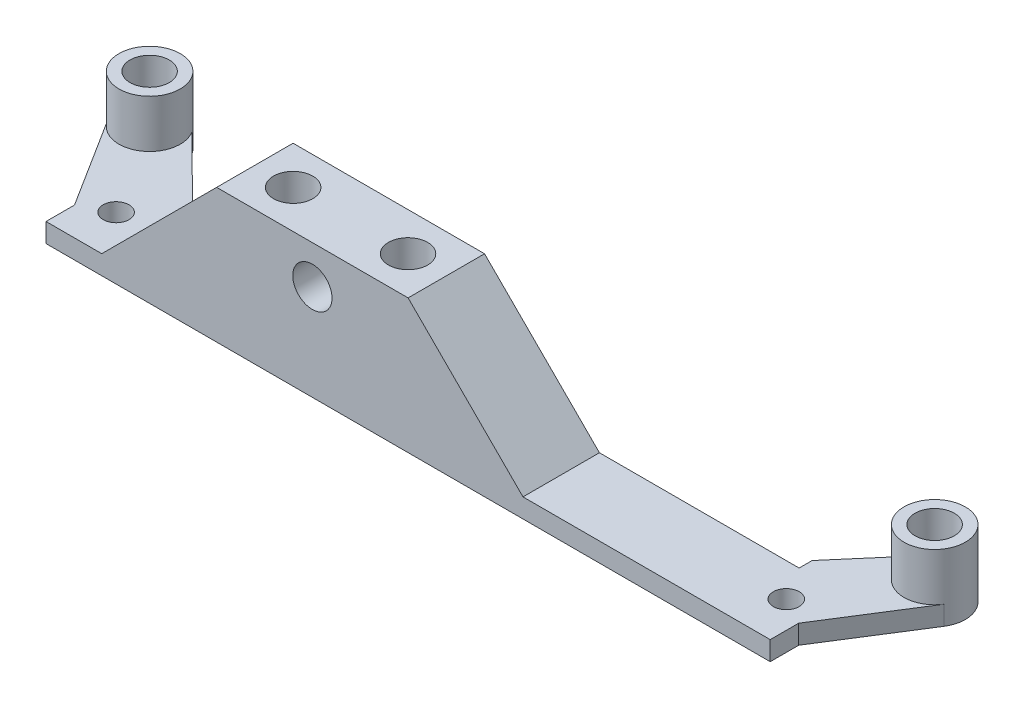
ISO-10303-21;
HEADER;
FILE_DESCRIPTION(('STEP AP214'),'2;1');
FILE_NAME('part.step','',(''),(''),'','','');
FILE_SCHEMA(('AUTOMOTIVE_DESIGN { 1 0 10303 214 1 1 1 1 }'));
ENDSEC;
DATA;
#1=APPLICATION_CONTEXT('core data for automotive mechanical design processes');
#2=APPLICATION_PROTOCOL_DEFINITION('international standard','automotive_design',2000,#1);
#3=PRODUCT_CONTEXT('',#1,'mechanical');
#4=PRODUCT('Part','Part','',(#3));
#5=PRODUCT_RELATED_PRODUCT_CATEGORY('part','',(#4));
#6=PRODUCT_DEFINITION_FORMATION('','',#4);
#7=PRODUCT_DEFINITION_CONTEXT('part definition',#1,'design');
#8=PRODUCT_DEFINITION('design','',#6,#7);
#9=PRODUCT_DEFINITION_SHAPE('','',#8);
#10=(LENGTH_UNIT() NAMED_UNIT(*) SI_UNIT(.MILLI.,.METRE.));
#11=(NAMED_UNIT(*) PLANE_ANGLE_UNIT() SI_UNIT($,.RADIAN.));
#12=(NAMED_UNIT(*) SI_UNIT($,.STERADIAN.) SOLID_ANGLE_UNIT());
#13=UNCERTAINTY_MEASURE_WITH_UNIT(LENGTH_MEASURE(1.E-05),#10,'distance_accuracy_value','');
#14=(GEOMETRIC_REPRESENTATION_CONTEXT(3) GLOBAL_UNCERTAINTY_ASSIGNED_CONTEXT((#13)) GLOBAL_UNIT_ASSIGNED_CONTEXT((#10,
#11,#12)) REPRESENTATION_CONTEXT('',''));
#15=CARTESIAN_POINT('',(0.,0.,0.));
#16=DIRECTION('',(0.,0.,1.));
#17=DIRECTION('',(1.,0.,0.));
#18=AXIS2_PLACEMENT_3D('',#15,#16,#17);
#19=CARTESIAN_POINT('',(50.2954250844381,2.,24.539505555981));
#20=DIRECTION('',(0.,-1.,0.));
#21=DIRECTION('',(0.,0.,1.));
#22=AXIS2_PLACEMENT_3D('',#19,#20,#21);
#23=PLANE('',#22);
#24=CARTESIAN_POINT('',(44.2954250844381,2.,34.0395055559811));
#25=DIRECTION('',(0.,-1.,0.));
#26=DIRECTION('',(0.,0.,-1.));
#27=AXIS2_PLACEMENT_3D('',#24,#25,#26);
#28=CIRCLE('',#27,1.35);
#29=CARTESIAN_POINT('',(44.2954250844381,2.,32.6895055559811));
#30=VERTEX_POINT('',#29);
#31=EDGE_CURVE('E231',#30,#30,#28,.T.);
#32=ORIENTED_EDGE('',*,*,#31,.T.);
#33=EDGE_LOOP('',(#32));
#34=FACE_BOUND('',#33,.T.);
#35=DIRECTION('',(-1.,0.,0.));
#36=VECTOR('',#35,1.);
#37=CARTESIAN_POINT('',(-28.5276596570278,2.,38.5395055559811));
#38=LINE('',#37,#36);
#39=CARTESIAN_POINT('',(47.1182480924058,2.,38.5395055559811));
#40=VERTEX_POINT('',#39);
#41=CARTESIAN_POINT('',(21.2954250843891,2.,38.5395055559811));
#42=VERTEX_POINT('',#41);
#43=EDGE_CURVE('E165',#40,#42,#38,.T.);
#44=ORIENTED_EDGE('',*,*,#43,.F.);
#45=DIRECTION('',(0.,0.,1.));
#46=VECTOR('',#45,1.);
#47=CARTESIAN_POINT('',(47.1182480924058,2.,38.5395055559811));
#48=LINE('',#47,#46);
#49=CARTESIAN_POINT('',(47.1182480924058,2.,35.5626238078308));
#50=VERTEX_POINT('',#49);
#51=EDGE_CURVE('E199',#50,#40,#48,.T.);
#52=ORIENTED_EDGE('',*,*,#51,.F.);
#53=DIRECTION('',(-0.53399299138798,0.,0.845488903030973));
#54=VECTOR('',#53,1.);
#55=CARTESIAN_POINT('',(53.0009895741372,2.,26.2482831284226));
#56=LINE('',#55,#54);
#57=CARTESIAN_POINT('',(53.0009895741372,2.,26.2482831284226));
#58=VERTEX_POINT('',#57);
#59=EDGE_CURVE('E234',#58,#50,#56,.T.);
#60=ORIENTED_EDGE('',*,*,#59,.F.);
#61=CARTESIAN_POINT('',(50.2954250844381,2.,24.539505555981));
#62=DIRECTION('',(0.,-1.,0.));
#63=DIRECTION('',(0.,0.,-1.));
#64=AXIS2_PLACEMENT_3D('',#61,#62,#63);
#65=CIRCLE('',#64,3.20000000000002);
#66=CARTESIAN_POINT('',(47.5379021217262,2.,22.9159085893305));
#67=VERTEX_POINT('',#66);
#68=EDGE_CURVE('E283',#58,#67,#65,.T.);
#69=ORIENTED_EDGE('',*,*,#68,.T.);
#70=DIRECTION('',(0.65088317788447,0.,-0.759177903226256));
#71=VECTOR('',#70,1.);
#72=CARTESIAN_POINT('',(42.1517451114346,2.,29.1982208758625));
#73=LINE('',#72,#71);
#74=CARTESIAN_POINT('',(42.1517451114346,2.,29.1982208758625));
#75=VERTEX_POINT('',#74);
#76=EDGE_CURVE('E237',#75,#67,#73,.T.);
#77=ORIENTED_EDGE('',*,*,#76,.F.);
#78=DIRECTION('',(0.,0.,-1.));
#79=VECTOR('',#78,1.);
#80=CARTESIAN_POINT('',(42.1517451114346,2.,29.1982208758625));
#81=LINE('',#80,#79);
#82=CARTESIAN_POINT('',(42.1517451114346,2.,30.5548807448663));
#83=VERTEX_POINT('',#82);
#84=EDGE_CURVE('E240',#83,#75,#81,.T.);
#85=ORIENTED_EDGE('',*,*,#84,.F.);
#86=DIRECTION('',(1.,0.,0.));
#87=VECTOR('',#86,1.);
#88=CARTESIAN_POINT('',(-21.197718512781,2.,30.5548807448663));
#89=LINE('',#88,#87);
#90=CARTESIAN_POINT('',(21.2954250843891,2.,30.5548807448663));
#91=VERTEX_POINT('',#90);
#92=EDGE_CURVE('E297',#91,#83,#89,.T.);
#93=ORIENTED_EDGE('',*,*,#92,.F.);
#94=DIRECTION('',(0.,0.,-1.));
#95=VECTOR('',#94,1.);
#96=CARTESIAN_POINT('',(21.2954250843891,2.,30.5548807448663));
#97=LINE('',#96,#95);
#98=EDGE_CURVE('E169',#42,#91,#97,.T.);
#99=ORIENTED_EDGE('',*,*,#98,.F.);
#100=EDGE_LOOP('',(#44,#52,#60,#69,#77,#85,#93,#99));
#101=FACE_BOUND('',#100,.T.);
#102=ADVANCED_FACE('F35',(#34,#101),#23,.F.);
#103=CARTESIAN_POINT('',(-25.7045749155619,2.,34.0395055559811));
#104=DIRECTION('',(0.,-1.,0.));
#105=DIRECTION('',(0.,0.,-1.));
#106=AXIS2_PLACEMENT_3D('',#103,#104,#105);
#107=CIRCLE('',#106,1.35);
#108=CARTESIAN_POINT('',(-25.7045749155619,2.,32.6895055559811));
#109=VERTEX_POINT('',#108);
#110=EDGE_CURVE('E261',#109,#109,#107,.T.);
#111=ORIENTED_EDGE('',*,*,#110,.T.);
#112=EDGE_LOOP('',(#111));
#113=FACE_BOUND('',#112,.T.);
#114=DIRECTION('',(0.710611314616584,0.,0.703584792003701));
#115=VECTOR('',#114,1.);
#116=CARTESIAN_POINT('',(-28.9990104258628,2.,22.8307279835395));
#117=LINE('',#116,#115);
#118=CARTESIAN_POINT('',(-28.9990104258628,2.,22.8307279835395));
#119=VERTEX_POINT('',#118);
#120=CARTESIAN_POINT('',(-22.7045749156108,2.,29.0629241337666));
#121=VERTEX_POINT('',#120);
#122=EDGE_CURVE('E243',#119,#121,#117,.T.);
#123=ORIENTED_EDGE('',*,*,#122,.F.);
#124=CARTESIAN_POINT('',(-31.7045749155619,2.,24.539505555981));
#125=DIRECTION('',(0.,-1.,0.));
#126=DIRECTION('',(0.,0.,-1.));
#127=AXIS2_PLACEMENT_3D('',#124,#125,#126);
#128=CIRCLE('',#127,3.2);
#129=CARTESIAN_POINT('',(-34.410139405261,2.,26.2482831284225));
#130=VERTEX_POINT('',#129);
#131=EDGE_CURVE('E271',#119,#130,#128,.T.);
#132=ORIENTED_EDGE('',*,*,#131,.T.);
#133=DIRECTION('',(-0.533969233102133,0.,-0.84550390779719));
#134=VECTOR('',#133,1.);
#135=CARTESIAN_POINT('',(-34.410139405261,2.,26.2482831284225));
#136=LINE('',#135,#134);
#137=CARTESIAN_POINT('',(-28.5276596570278,2.,35.5627891080539));
#138=VERTEX_POINT('',#137);
#139=EDGE_CURVE('E246',#138,#130,#136,.T.);
#140=ORIENTED_EDGE('',*,*,#139,.F.);
#141=DIRECTION('',(0.,0.,-1.));
#142=VECTOR('',#141,1.);
#143=CARTESIAN_POINT('',(-28.5276596570278,2.,38.5395055559811));
#144=LINE('',#143,#142);
#145=CARTESIAN_POINT('',(-28.5276596570278,2.,38.5395055559811));
#146=VERTEX_POINT('',#145);
#147=EDGE_CURVE('E249',#146,#138,#144,.T.);
#148=ORIENTED_EDGE('',*,*,#147,.F.);
#149=CARTESIAN_POINT('',(-22.7045749156108,2.,38.5395055559811));
#150=VERTEX_POINT('',#149);
#151=EDGE_CURVE('E203',#150,#146,#38,.T.);
#152=ORIENTED_EDGE('',*,*,#151,.F.);
#153=DIRECTION('',(0.,0.,1.));
#154=VECTOR('',#153,1.);
#155=CARTESIAN_POINT('',(-22.7045749156108,2.,38.5395055559811));
#156=LINE('',#155,#154);
#157=EDGE_CURVE('E166',#121,#150,#156,.T.);
#158=ORIENTED_EDGE('',*,*,#157,.F.);
#159=EDGE_LOOP('',(#123,#132,#140,#148,#152,#158));
#160=FACE_BOUND('',#159,.T.);
#161=ADVANCED_FACE('F331',(#113,#160),#23,.F.);
#162=CARTESIAN_POINT('',(50.2954250844381,0.,24.539505555981));
#163=DIRECTION('',(0.,-1.,0.));
#164=DIRECTION('',(0.,0.,1.));
#165=AXIS2_PLACEMENT_3D('',#162,#163,#164);
#166=PLANE('',#165);
#167=DIRECTION('',(0.,0.,-1.));
#168=VECTOR('',#167,1.);
#169=CARTESIAN_POINT('',(-28.5276596570278,0.,38.5395055559811));
#170=LINE('',#169,#168);
#171=CARTESIAN_POINT('',(-28.5276596570278,0.,38.5395055559811));
#172=VERTEX_POINT('',#171);
#173=CARTESIAN_POINT('',(-28.5276596570278,0.,35.5627891080539));
#174=VERTEX_POINT('',#173);
#175=EDGE_CURVE('E225',#172,#174,#170,.T.);
#176=ORIENTED_EDGE('',*,*,#175,.T.);
#177=DIRECTION('',(-0.533969233102133,0.,-0.84550390779719));
#178=VECTOR('',#177,1.);
#179=CARTESIAN_POINT('',(-34.410139405261,0.,26.2482831284225));
#180=LINE('',#179,#178);
#181=CARTESIAN_POINT('',(-34.410139405261,0.,26.2482831284225));
#182=VERTEX_POINT('',#181);
#183=EDGE_CURVE('E222',#174,#182,#180,.T.);
#184=ORIENTED_EDGE('',*,*,#183,.T.);
#185=CARTESIAN_POINT('',(-31.7045749155619,0.,24.539505555981));
#186=DIRECTION('',(0.,-1.,0.));
#187=DIRECTION('',(0.,0.,-1.));
#188=AXIS2_PLACEMENT_3D('',#185,#186,#187);
#189=CIRCLE('',#188,3.2);
#190=CARTESIAN_POINT('',(-28.9990104258628,0.,22.8307279835395));
#191=VERTEX_POINT('',#190);
#192=EDGE_CURVE('E219',#182,#191,#189,.T.);
#193=ORIENTED_EDGE('',*,*,#192,.T.);
#194=DIRECTION('',(0.710611314616584,0.,0.703584792003701));
#195=VECTOR('',#194,1.);
#196=CARTESIAN_POINT('',(-28.9990104258628,0.,22.8307279835395));
#197=LINE('',#196,#195);
#198=CARTESIAN_POINT('',(-21.197718512781,0.,30.5548807448663));
#199=VERTEX_POINT('',#198);
#200=EDGE_CURVE('E216',#191,#199,#197,.T.);
#201=ORIENTED_EDGE('',*,*,#200,.T.);
#202=DIRECTION('',(1.,0.,0.));
#203=VECTOR('',#202,1.);
#204=CARTESIAN_POINT('',(-21.197718512781,0.,30.5548807448663));
#205=LINE('',#204,#203);
#206=CARTESIAN_POINT('',(42.1517451114346,0.,30.5548807448663));
#207=VERTEX_POINT('',#206);
#208=EDGE_CURVE('E294',#199,#207,#205,.T.);
#209=ORIENTED_EDGE('',*,*,#208,.T.);
#210=DIRECTION('',(0.,0.,-1.));
#211=VECTOR('',#210,1.);
#212=CARTESIAN_POINT('',(42.1517451114346,0.,29.1982208758625));
#213=LINE('',#212,#211);
#214=CARTESIAN_POINT('',(42.1517451114346,0.,29.1982208758625));
#215=VERTEX_POINT('',#214);
#216=EDGE_CURVE('E213',#207,#215,#213,.T.);
#217=ORIENTED_EDGE('',*,*,#216,.T.);
#218=DIRECTION('',(0.65088317788447,0.,-0.759177903226256));
#219=VECTOR('',#218,1.);
#220=CARTESIAN_POINT('',(42.1517451114346,0.,29.1982208758625));
#221=LINE('',#220,#219);
#222=CARTESIAN_POINT('',(48.2697894922181,0.,22.0622489185833));
#223=VERTEX_POINT('',#222);
#224=EDGE_CURVE('E210',#215,#223,#221,.T.);
#225=ORIENTED_EDGE('',*,*,#224,.T.);
#226=CARTESIAN_POINT('',(50.2954250844381,0.,24.539505555981));
#227=DIRECTION('',(0.,-1.,0.));
#228=DIRECTION('',(0.,0.,1.));
#229=AXIS2_PLACEMENT_3D('',#226,#227,#228);
#230=CIRCLE('',#229,3.2);
#231=CARTESIAN_POINT('',(53.0009895741372,0.,26.2482831284226));
#232=VERTEX_POINT('',#231);
#233=EDGE_CURVE('E207',#223,#232,#230,.T.);
#234=ORIENTED_EDGE('',*,*,#233,.T.);
#235=DIRECTION('',(-0.53399299138798,0.,0.845488903030973));
#236=VECTOR('',#235,1.);
#237=CARTESIAN_POINT('',(53.0009895741372,0.,26.2482831284226));
#238=LINE('',#237,#236);
#239=CARTESIAN_POINT('',(47.1182480924058,0.,35.5626238078308));
#240=VERTEX_POINT('',#239);
#241=EDGE_CURVE('E204',#232,#240,#238,.T.);
#242=ORIENTED_EDGE('',*,*,#241,.T.);
#243=DIRECTION('',(0.,0.,1.));
#244=VECTOR('',#243,1.);
#245=CARTESIAN_POINT('',(47.1182480924058,0.,38.5395055559811));
#246=LINE('',#245,#244);
#247=CARTESIAN_POINT('',(47.1182480924058,0.,38.5395055559811));
#248=VERTEX_POINT('',#247);
#249=EDGE_CURVE('E200',#240,#248,#246,.T.);
#250=ORIENTED_EDGE('',*,*,#249,.T.);
#251=DIRECTION('',(-1.,0.,0.));
#252=VECTOR('',#251,1.);
#253=CARTESIAN_POINT('',(-28.5276596570278,0.,38.5395055559811));
#254=LINE('',#253,#252);
#255=EDGE_CURVE('E228',#248,#172,#254,.T.);
#256=ORIENTED_EDGE('',*,*,#255,.T.);
#257=EDGE_LOOP('',(#176,#184,#193,#201,#209,#217,#225,#234,#242,#250,#256));
#258=FACE_BOUND('',#257,.T.);
#259=CARTESIAN_POINT('',(-25.7045749155619,0.,34.0395055559811));
#260=DIRECTION('',(0.,-1.,0.));
#261=DIRECTION('',(0.,0.,-1.));
#262=AXIS2_PLACEMENT_3D('',#259,#260,#261);
#263=CIRCLE('',#262,1.35);
#264=CARTESIAN_POINT('',(-25.7045749155619,0.,32.6895055559811));
#265=VERTEX_POINT('',#264);
#266=EDGE_CURVE('E262',#265,#265,#263,.T.);
#267=ORIENTED_EDGE('',*,*,#266,.F.);
#268=EDGE_LOOP('',(#267));
#269=FACE_BOUND('',#268,.T.);
#270=CARTESIAN_POINT('',(-31.7045749155619,0.,24.539505555981));
#271=DIRECTION('',(0.,-1.,0.));
#272=DIRECTION('',(0.,0.,-1.));
#273=AXIS2_PLACEMENT_3D('',#270,#271,#272);
#274=CIRCLE('',#273,2.05);
#275=CARTESIAN_POINT('',(-31.7045749155619,0.,22.489505555981));
#276=VERTEX_POINT('',#275);
#277=EDGE_CURVE('E256',#276,#276,#274,.T.);
#278=ORIENTED_EDGE('',*,*,#277,.F.);
#279=EDGE_LOOP('',(#278));
#280=FACE_BOUND('',#279,.T.);
#281=CARTESIAN_POINT('',(44.2954250844381,0.,34.0395055559811));
#282=DIRECTION('',(0.,-1.,0.));
#283=DIRECTION('',(0.,0.,-1.));
#284=AXIS2_PLACEMENT_3D('',#281,#282,#283);
#285=CIRCLE('',#284,1.35);
#286=CARTESIAN_POINT('',(44.2954250844381,0.,32.6895055559811));
#287=VERTEX_POINT('',#286);
#288=EDGE_CURVE('E253',#287,#287,#285,.T.);
#289=ORIENTED_EDGE('',*,*,#288,.F.);
#290=EDGE_LOOP('',(#289));
#291=FACE_BOUND('',#290,.T.);
#292=CARTESIAN_POINT('',(50.2954250844381,0.,24.539505555981));
#293=DIRECTION('',(0.,-1.,0.));
#294=DIRECTION('',(0.,0.,1.));
#295=AXIS2_PLACEMENT_3D('',#292,#293,#294);
#296=CIRCLE('',#295,2.04999999999999);
#297=CARTESIAN_POINT('',(50.2954250844381,0.,26.589505555981));
#298=VERTEX_POINT('',#297);
#299=EDGE_CURVE('E265',#298,#298,#296,.T.);
#300=ORIENTED_EDGE('',*,*,#299,.F.);
#301=EDGE_LOOP('',(#300));
#302=FACE_BOUND('',#301,.T.);
#303=ADVANCED_FACE('F337',(#258,#269,#280,#291,#302),#166,.T.);
#304=CARTESIAN_POINT('',(-28.5276596570278,2.,38.5395055559811));
#305=DIRECTION('',(0.,0.,-1.));
#306=DIRECTION('',(1.,0.,0.));
#307=AXIS2_PLACEMENT_3D('',#304,#305,#306);
#308=PLANE('',#307);
#309=CARTESIAN_POINT('',(-0.704574915610868,10.,38.5395055559811));
#310=DIRECTION('',(0.,0.,-1.));
#311=DIRECTION('',(-1.,0.,0.));
#312=AXIS2_PLACEMENT_3D('',#309,#310,#311);
#313=CIRCLE('',#312,2.05);
#314=CARTESIAN_POINT('',(-2.75457491561087,10.,38.5395055559811));
#315=VERTEX_POINT('',#314);
#316=EDGE_CURVE('E179',#315,#315,#313,.T.);
#317=ORIENTED_EDGE('',*,*,#316,.T.);
#318=EDGE_LOOP('',(#317));
#319=FACE_BOUND('',#318,.T.);
#320=DIRECTION('',(0.,-1.,0.));
#321=VECTOR('',#320,1.);
#322=CARTESIAN_POINT('',(-28.5276596570278,2.,38.5395055559811));
#323=LINE('',#322,#321);
#324=EDGE_CURVE('E174',#146,#172,#323,.T.);
#325=ORIENTED_EDGE('',*,*,#324,.T.);
#326=ORIENTED_EDGE('',*,*,#255,.F.);
#327=DIRECTION('',(0.,-1.,0.));
#328=VECTOR('',#327,1.);
#329=CARTESIAN_POINT('',(47.1182480924058,2.,38.5395055559811));
#330=LINE('',#329,#328);
#331=EDGE_CURVE('E197',#40,#248,#330,.T.);
#332=ORIENTED_EDGE('',*,*,#331,.F.);
#333=ORIENTED_EDGE('',*,*,#43,.T.);
#334=DIRECTION('',(-0.707106781186546,0.707106781186549,0.));
#335=VECTOR('',#334,1.);
#336=CARTESIAN_POINT('',(-3.61611728631925,26.9115423707084,38.5395055559811));
#337=LINE('',#336,#335);
#338=CARTESIAN_POINT('',(9.29542508438913,14.,38.5395055559811));
#339=VERTEX_POINT('',#338);
#340=EDGE_CURVE('E148',#339,#42,#337,.F.);
#341=ORIENTED_EDGE('',*,*,#340,.F.);
#342=DIRECTION('',(-1.,0.,0.));
#343=VECTOR('',#342,1.);
#344=CARTESIAN_POINT('',(9.29542508438913,14.,38.5395055559811));
#345=LINE('',#344,#343);
#346=CARTESIAN_POINT('',(-10.7045749156109,14.,38.5395055559811));
#347=VERTEX_POINT('',#346);
#348=EDGE_CURVE('E154',#339,#347,#345,.T.);
#349=ORIENTED_EDGE('',*,*,#348,.T.);
#350=DIRECTION('',(-0.707106781186546,-0.707106781186549,0.));
#351=VECTOR('',#350,1.);
#352=CARTESIAN_POINT('',(-25.6161172863193,-0.91154237070848,38.5395055559811));
#353=LINE('',#352,#351);
#354=EDGE_CURVE('E11',#150,#347,#353,.F.);
#355=ORIENTED_EDGE('',*,*,#354,.F.);
#356=ORIENTED_EDGE('',*,*,#151,.T.);
#357=EDGE_LOOP('',(#325,#326,#332,#333,#341,#349,#355,#356));
#358=FACE_BOUND('',#357,.T.);
#359=ADVANCED_FACE('F163',(#319,#358),#308,.F.);
#360=CARTESIAN_POINT('',(-28.5276596570278,2.,38.5395055559811));
#361=DIRECTION('',(1.,0.,0.));
#362=DIRECTION('',(0.,0.,1.));
#363=AXIS2_PLACEMENT_3D('',#360,#361,#362);
#364=PLANE('',#363);
#365=ORIENTED_EDGE('',*,*,#175,.F.);
#366=ORIENTED_EDGE('',*,*,#324,.F.);
#367=ORIENTED_EDGE('',*,*,#147,.T.);
#368=DIRECTION('',(0.,-1.,0.));
#369=VECTOR('',#368,1.);
#370=CARTESIAN_POINT('',(-28.5276596570278,2.,35.5627891080539));
#371=LINE('',#370,#369);
#372=EDGE_CURVE('E181',#138,#174,#371,.T.);
#373=ORIENTED_EDGE('',*,*,#372,.T.);
#374=EDGE_LOOP('',(#365,#366,#367,#373));
#375=FACE_BOUND('',#374,.T.);
#376=ADVANCED_FACE('F378',(#375),#364,.F.);
#377=CARTESIAN_POINT('',(-34.410139405261,2.,26.2482831284225));
#378=DIRECTION('',(0.84550390779719,0.,-0.533969233102133));
#379=DIRECTION('',(0.533969233102133,0.,0.84550390779719));
#380=AXIS2_PLACEMENT_3D('',#377,#378,#379);
#381=PLANE('',#380);
#382=ORIENTED_EDGE('',*,*,#183,.F.);
#383=ORIENTED_EDGE('',*,*,#372,.F.);
#384=ORIENTED_EDGE('',*,*,#139,.T.);
#385=DIRECTION('',(0.,-1.,0.));
#386=VECTOR('',#385,1.);
#387=CARTESIAN_POINT('',(-34.410139405261,2.,26.2482831284225));
#388=LINE('',#387,#386);
#389=EDGE_CURVE('E183',#130,#182,#388,.T.);
#390=ORIENTED_EDGE('',*,*,#389,.T.);
#391=EDGE_LOOP('',(#382,#383,#384,#390));
#392=FACE_BOUND('',#391,.T.);
#393=ADVANCED_FACE('F374',(#392),#381,.F.);
#394=CARTESIAN_POINT('',(-31.7045749155619,2.,24.539505555981));
#395=DIRECTION('',(0.,-1.,0.));
#396=DIRECTION('',(0.,0.,1.));
#397=AXIS2_PLACEMENT_3D('',#394,#395,#396);
#398=CYLINDRICAL_SURFACE('',#397,3.2);
#399=ORIENTED_EDGE('',*,*,#192,.F.);
#400=ORIENTED_EDGE('',*,*,#389,.F.);
#401=ORIENTED_EDGE('',*,*,#131,.F.);
#402=DIRECTION('',(0.,-1.,0.));
#403=VECTOR('',#402,1.);
#404=CARTESIAN_POINT('',(-28.9990104258628,2.,22.8307279835395));
#405=LINE('',#404,#403);
#406=EDGE_CURVE('E185',#119,#191,#405,.T.);
#407=ORIENTED_EDGE('',*,*,#406,.T.);
#408=EDGE_LOOP('',(#399,#400,#401,#407));
#409=FACE_BOUND('',#408,.T.);
#410=CARTESIAN_POINT('',(-31.7045749155619,7.,24.539505555981));
#411=DIRECTION('',(0.,-1.,0.));
#412=DIRECTION('',(0.,0.,-1.));
#413=AXIS2_PLACEMENT_3D('',#410,#411,#412);
#414=CIRCLE('',#413,3.2);
#415=CARTESIAN_POINT('',(-31.7045749155619,7.,21.339505555981));
#416=VERTEX_POINT('',#415);
#417=EDGE_CURVE('E270',#416,#416,#414,.T.);
#418=ORIENTED_EDGE('',*,*,#417,.T.);
#419=EDGE_LOOP('',(#418));
#420=FACE_BOUND('',#419,.T.);
#421=ADVANCED_FACE('F370',(#409,#420),#398,.T.);
#422=CARTESIAN_POINT('',(-28.9990104258628,2.,22.8307279835395));
#423=DIRECTION('',(-0.703584792003701,0.,0.710611314616584));
#424=DIRECTION('',(-0.710611314616584,0.,-0.703584792003701));
#425=AXIS2_PLACEMENT_3D('',#422,#423,#424);
#426=PLANE('',#425);
#427=ORIENTED_EDGE('',*,*,#200,.F.);
#428=ORIENTED_EDGE('',*,*,#406,.F.);
#429=ORIENTED_EDGE('',*,*,#122,.T.);
#430=DIRECTION('',(0.579253173532803,0.579253173532805,0.573525519837043));
#431=VECTOR('',#430,1.);
#432=CARTESIAN_POINT('',(-26.8870117966948,-2.18243688108396,24.9218431764027));
#433=LINE('',#432,#431);
#434=CARTESIAN_POINT('',(-21.197718512781,3.50685640282978,30.5548807448663));
#435=VERTEX_POINT('',#434);
#436=EDGE_CURVE('E43',#435,#121,#433,.F.);
#437=ORIENTED_EDGE('',*,*,#436,.F.);
#438=DIRECTION('',(0.,-1.,0.));
#439=VECTOR('',#438,1.);
#440=CARTESIAN_POINT('',(-21.197718512781,2.,30.5548807448663));
#441=LINE('',#440,#439);
#442=EDGE_CURVE('E187',#435,#199,#441,.T.);
#443=ORIENTED_EDGE('',*,*,#442,.T.);
#444=EDGE_LOOP('',(#427,#428,#429,#437,#443));
#445=FACE_BOUND('',#444,.T.);
#446=ADVANCED_FACE('F366',(#445),#426,.F.);
#447=CARTESIAN_POINT('',(42.1517451114346,2.,29.1982208758625));
#448=DIRECTION('',(1.,0.,0.));
#449=DIRECTION('',(0.,0.,1.));
#450=AXIS2_PLACEMENT_3D('',#447,#448,#449);
#451=PLANE('',#450);
#452=ORIENTED_EDGE('',*,*,#84,.T.);
#453=DIRECTION('',(0.,-1.,0.));
#454=VECTOR('',#453,1.);
#455=CARTESIAN_POINT('',(42.1517451114346,2.,29.1982208758625));
#456=LINE('',#455,#454);
#457=EDGE_CURVE('E189',#75,#215,#456,.T.);
#458=ORIENTED_EDGE('',*,*,#457,.T.);
#459=ORIENTED_EDGE('',*,*,#216,.F.);
#460=DIRECTION('',(0.,1.,0.));
#461=VECTOR('',#460,1.);
#462=CARTESIAN_POINT('',(42.1517451114346,-63.850675602143,30.5548807448663));
#463=LINE('',#462,#461);
#464=EDGE_CURVE('E292',#207,#83,#463,.T.);
#465=ORIENTED_EDGE('',*,*,#464,.T.);
#466=EDGE_LOOP('',(#452,#458,#459,#465));
#467=FACE_BOUND('',#466,.T.);
#468=ADVANCED_FACE('F362',(#467),#451,.F.);
#469=CARTESIAN_POINT('',(42.1517451114346,2.,29.1982208758625));
#470=DIRECTION('',(0.759177903226255,0.,0.65088317788447));
#471=DIRECTION('',(-0.65088317788447,0.,0.759177903226256));
#472=AXIS2_PLACEMENT_3D('',#469,#470,#471);
#473=PLANE('',#472);
#474=ORIENTED_EDGE('',*,*,#224,.F.);
#475=ORIENTED_EDGE('',*,*,#457,.F.);
#476=ORIENTED_EDGE('',*,*,#76,.T.);
#477=DIRECTION('',(0.65088317788447,0.,-0.759177903226256));
#478=VECTOR('',#477,1.);
#479=CARTESIAN_POINT('',(42.1517451114346,2.,29.1982208758625));
#480=LINE('',#479,#478);
#481=CARTESIAN_POINT('',(48.2697894922181,2.,22.0622489185833));
#482=VERTEX_POINT('',#481);
#483=EDGE_CURVE('E279',#67,#482,#480,.T.);
#484=ORIENTED_EDGE('',*,*,#483,.T.);
#485=DIRECTION('',(0.,-1.,0.));
#486=VECTOR('',#485,1.);
#487=CARTESIAN_POINT('',(48.2697894922181,2.,22.0622489185833));
#488=LINE('',#487,#486);
#489=EDGE_CURVE('E191',#482,#223,#488,.T.);
#490=ORIENTED_EDGE('',*,*,#489,.T.);
#491=EDGE_LOOP('',(#474,#475,#476,#484,#490));
#492=FACE_BOUND('',#491,.T.);
#493=ADVANCED_FACE('F358',(#492),#473,.F.);
#494=CARTESIAN_POINT('',(50.2954250844381,2.,24.539505555981));
#495=DIRECTION('',(0.,-1.,0.));
#496=DIRECTION('',(0.,0.,1.));
#497=AXIS2_PLACEMENT_3D('',#494,#495,#496);
#498=CYLINDRICAL_SURFACE('',#497,3.2);
#499=ORIENTED_EDGE('',*,*,#233,.F.);
#500=ORIENTED_EDGE('',*,*,#489,.F.);
#501=EDGE_CURVE('E286',#67,#482,#65,.T.);
#502=ORIENTED_EDGE('',*,*,#501,.F.);
#503=ORIENTED_EDGE('',*,*,#68,.F.);
#504=DIRECTION('',(0.,-1.,0.));
#505=VECTOR('',#504,1.);
#506=CARTESIAN_POINT('',(53.0009895741372,2.,26.2482831284226));
#507=LINE('',#506,#505);
#508=EDGE_CURVE('E193',#58,#232,#507,.T.);
#509=ORIENTED_EDGE('',*,*,#508,.T.);
#510=EDGE_LOOP('',(#499,#500,#502,#503,#509));
#511=FACE_BOUND('',#510,.T.);
#512=CARTESIAN_POINT('',(50.2954250844381,7.,24.539505555981));
#513=DIRECTION('',(0.,-1.,0.));
#514=DIRECTION('',(0.,0.,-1.));
#515=AXIS2_PLACEMENT_3D('',#512,#513,#514);
#516=CIRCLE('',#515,3.20000000000002);
#517=CARTESIAN_POINT('',(50.2954250844381,7.,21.339505555981));
#518=VERTEX_POINT('',#517);
#519=EDGE_CURVE('E282',#518,#518,#516,.T.);
#520=ORIENTED_EDGE('',*,*,#519,.T.);
#521=EDGE_LOOP('',(#520));
#522=FACE_BOUND('',#521,.T.);
#523=ADVANCED_FACE('F354',(#511,#522),#498,.T.);
#524=CARTESIAN_POINT('',(53.0009895741372,2.,26.2482831284226));
#525=DIRECTION('',(-0.845488903030973,0.,-0.533992991387979));
#526=DIRECTION('',(0.533992991387979,0.,-0.845488903030973));
#527=AXIS2_PLACEMENT_3D('',#524,#525,#526);
#528=PLANE('',#527);
#529=ORIENTED_EDGE('',*,*,#241,.F.);
#530=ORIENTED_EDGE('',*,*,#508,.F.);
#531=ORIENTED_EDGE('',*,*,#59,.T.);
#532=DIRECTION('',(0.,-1.,0.));
#533=VECTOR('',#532,1.);
#534=CARTESIAN_POINT('',(47.1182480924058,2.,35.5626238078308));
#535=LINE('',#534,#533);
#536=EDGE_CURVE('E195',#50,#240,#535,.T.);
#537=ORIENTED_EDGE('',*,*,#536,.T.);
#538=EDGE_LOOP('',(#529,#530,#531,#537));
#539=FACE_BOUND('',#538,.T.);
#540=ADVANCED_FACE('F350',(#539),#528,.F.);
#541=CARTESIAN_POINT('',(47.1182480924058,2.,38.5395055559811));
#542=DIRECTION('',(-1.,0.,0.));
#543=DIRECTION('',(0.,0.,-1.));
#544=AXIS2_PLACEMENT_3D('',#541,#542,#543);
#545=PLANE('',#544);
#546=ORIENTED_EDGE('',*,*,#249,.F.);
#547=ORIENTED_EDGE('',*,*,#536,.F.);
#548=ORIENTED_EDGE('',*,*,#51,.T.);
#549=ORIENTED_EDGE('',*,*,#331,.T.);
#550=EDGE_LOOP('',(#546,#547,#548,#549));
#551=FACE_BOUND('',#550,.T.);
#552=ADVANCED_FACE('F347',(#551),#545,.F.);
#553=CARTESIAN_POINT('',(44.2954250844381,2.,34.0395055559811));
#554=DIRECTION('',(0.,-1.,0.));
#555=DIRECTION('',(0.,0.,1.));
#556=AXIS2_PLACEMENT_3D('',#553,#554,#555);
#557=CYLINDRICAL_SURFACE('',#556,1.35);
#558=ORIENTED_EDGE('',*,*,#31,.F.);
#559=EDGE_LOOP('',(#558));
#560=FACE_BOUND('',#559,.T.);
#561=ORIENTED_EDGE('',*,*,#288,.T.);
#562=EDGE_LOOP('',(#561));
#563=FACE_BOUND('',#562,.T.);
#564=ADVANCED_FACE('F342',(#560,#563),#557,.F.);
#565=CARTESIAN_POINT('',(-31.7045749155619,2.,24.539505555981));
#566=DIRECTION('',(0.,-1.,0.));
#567=DIRECTION('',(0.,0.,1.));
#568=AXIS2_PLACEMENT_3D('',#565,#566,#567);
#569=CYLINDRICAL_SURFACE('',#568,2.05);
#570=ORIENTED_EDGE('',*,*,#277,.T.);
#571=EDGE_LOOP('',(#570));
#572=FACE_BOUND('',#571,.T.);
#573=CARTESIAN_POINT('',(-31.7045749155619,7.,24.539505555981));
#574=DIRECTION('',(0.,-1.,0.));
#575=DIRECTION('',(0.,0.,-1.));
#576=AXIS2_PLACEMENT_3D('',#573,#574,#575);
#577=CIRCLE('',#576,2.05);
#578=CARTESIAN_POINT('',(-31.7045749155619,7.,22.489505555981));
#579=VERTEX_POINT('',#578);
#580=EDGE_CURVE('E274',#579,#579,#577,.T.);
#581=ORIENTED_EDGE('',*,*,#580,.F.);
#582=EDGE_LOOP('',(#581));
#583=FACE_BOUND('',#582,.T.);
#584=ADVANCED_FACE('F430',(#572,#583),#569,.F.);
#585=CARTESIAN_POINT('',(-25.7045749155619,2.,34.0395055559811));
#586=DIRECTION('',(0.,-1.,0.));
#587=DIRECTION('',(0.,0.,1.));
#588=AXIS2_PLACEMENT_3D('',#585,#586,#587);
#589=CYLINDRICAL_SURFACE('',#588,1.35);
#590=ORIENTED_EDGE('',*,*,#110,.F.);
#591=EDGE_LOOP('',(#590));
#592=FACE_BOUND('',#591,.T.);
#593=ORIENTED_EDGE('',*,*,#266,.T.);
#594=EDGE_LOOP('',(#593));
#595=FACE_BOUND('',#594,.T.);
#596=ADVANCED_FACE('F437',(#592,#595),#589,.F.);
#597=CARTESIAN_POINT('',(50.2954250844381,2.,24.539505555981));
#598=DIRECTION('',(0.,-1.,0.));
#599=DIRECTION('',(0.,0.,1.));
#600=AXIS2_PLACEMENT_3D('',#597,#598,#599);
#601=CYLINDRICAL_SURFACE('',#600,2.04999999999999);
#602=ORIENTED_EDGE('',*,*,#299,.T.);
#603=EDGE_LOOP('',(#602));
#604=FACE_BOUND('',#603,.T.);
#605=CARTESIAN_POINT('',(50.2954250844381,7.,24.539505555981));
#606=DIRECTION('',(0.,-1.,0.));
#607=DIRECTION('',(0.,0.,-1.));
#608=AXIS2_PLACEMENT_3D('',#605,#606,#607);
#609=CIRCLE('',#608,2.04999999999999);
#610=CARTESIAN_POINT('',(50.2954250844381,7.,22.489505555981));
#611=VERTEX_POINT('',#610);
#612=EDGE_CURVE('E289',#611,#611,#609,.T.);
#613=ORIENTED_EDGE('',*,*,#612,.F.);
#614=EDGE_LOOP('',(#613));
#615=FACE_BOUND('',#614,.T.);
#616=ADVANCED_FACE('F444',(#604,#615),#601,.F.);
#617=CARTESIAN_POINT('',(-31.7045749155619,7.,24.539505555981));
#618=DIRECTION('',(0.,1.,0.));
#619=DIRECTION('',(0.,0.,-1.));
#620=AXIS2_PLACEMENT_3D('',#617,#618,#619);
#621=PLANE('',#620);
#622=ORIENTED_EDGE('',*,*,#417,.F.);
#623=EDGE_LOOP('',(#622));
#624=FACE_BOUND('',#623,.T.);
#625=ORIENTED_EDGE('',*,*,#580,.T.);
#626=EDGE_LOOP('',(#625));
#627=FACE_BOUND('',#626,.T.);
#628=ADVANCED_FACE('F452',(#624,#627),#621,.T.);
#629=CARTESIAN_POINT('',(50.2954250844381,2.,24.539505555981));
#630=DIRECTION('',(0.,1.,0.));
#631=DIRECTION('',(0.,0.,-1.));
#632=AXIS2_PLACEMENT_3D('',#629,#630,#631);
#633=PLANE('',#632);
#634=ORIENTED_EDGE('',*,*,#501,.T.);
#635=ORIENTED_EDGE('',*,*,#483,.F.);
#636=EDGE_LOOP('',(#634,#635));
#637=FACE_BOUND('',#636,.T.);
#638=ADVANCED_FACE('F460',(#637),#633,.F.);
#639=CARTESIAN_POINT('',(50.2954250844381,7.,24.539505555981));
#640=DIRECTION('',(0.,1.,0.));
#641=DIRECTION('',(0.,0.,-1.));
#642=AXIS2_PLACEMENT_3D('',#639,#640,#641);
#643=PLANE('',#642);
#644=ORIENTED_EDGE('',*,*,#519,.F.);
#645=EDGE_LOOP('',(#644));
#646=FACE_BOUND('',#645,.T.);
#647=ORIENTED_EDGE('',*,*,#612,.T.);
#648=EDGE_LOOP('',(#647));
#649=FACE_BOUND('',#648,.T.);
#650=ADVANCED_FACE('F468',(#646,#649),#643,.T.);
#651=CARTESIAN_POINT('',(-21.197718512781,-63.850675602143,30.5548807448663));
#652=DIRECTION('',(0.,0.,-1.));
#653=DIRECTION('',(1.,0.,0.));
#654=AXIS2_PLACEMENT_3D('',#651,#652,#653);
#655=PLANE('',#654);
#656=CARTESIAN_POINT('',(-0.704574915610868,10.,30.5548807448663));
#657=DIRECTION('',(0.,0.,1.));
#658=DIRECTION('',(1.,0.,0.));
#659=AXIS2_PLACEMENT_3D('',#656,#657,#658);
#660=CIRCLE('',#659,2.05);
#661=CARTESIAN_POINT('',(1.34542508438913,10.,30.5548807448663));
#662=VERTEX_POINT('',#661);
#663=EDGE_CURVE('E175',#662,#662,#660,.T.);
#664=ORIENTED_EDGE('',*,*,#663,.T.);
#665=EDGE_LOOP('',(#664));
#666=FACE_BOUND('',#665,.T.);
#667=ORIENTED_EDGE('',*,*,#442,.F.);
#668=DIRECTION('',(0.707106781186546,0.707106781186549,0.));
#669=VECTOR('',#668,1.);
#670=CARTESIAN_POINT('',(-10.7045749156109,14.,30.5548807448663));
#671=LINE('',#670,#669);
#672=CARTESIAN_POINT('',(-10.7045749156109,14.,30.5548807448663));
#673=VERTEX_POINT('',#672);
#674=EDGE_CURVE('E50',#673,#435,#671,.F.);
#675=ORIENTED_EDGE('',*,*,#674,.F.);
#676=DIRECTION('',(1.,0.,0.));
#677=VECTOR('',#676,1.);
#678=CARTESIAN_POINT('',(9.29542508438914,14.,30.5548807448663));
#679=LINE('',#678,#677);
#680=CARTESIAN_POINT('',(9.29542508438914,14.,30.5548807448663));
#681=VERTEX_POINT('',#680);
#682=EDGE_CURVE('E300',#673,#681,#679,.T.);
#683=ORIENTED_EDGE('',*,*,#682,.T.);
#684=DIRECTION('',(0.707106781186546,-0.707106781186549,0.));
#685=VECTOR('',#684,1.);
#686=CARTESIAN_POINT('',(9.29542508438913,14.,30.5548807448663));
#687=LINE('',#686,#685);
#688=EDGE_CURVE('E150',#91,#681,#687,.F.);
#689=ORIENTED_EDGE('',*,*,#688,.F.);
#690=ORIENTED_EDGE('',*,*,#92,.T.);
#691=ORIENTED_EDGE('',*,*,#464,.F.);
#692=ORIENTED_EDGE('',*,*,#208,.F.);
#693=EDGE_LOOP('',(#667,#675,#683,#689,#690,#691,#692));
#694=FACE_BOUND('',#693,.T.);
#695=ADVANCED_FACE('F476',(#666,#694),#655,.T.);
#696=CARTESIAN_POINT('',(0.,14.,0.));
#697=DIRECTION('',(0.,-1.,0.));
#698=DIRECTION('',(0.,0.,1.));
#699=AXIS2_PLACEMENT_3D('',#696,#697,#698);
#700=PLANE('',#699);
#701=CARTESIAN_POINT('',(-6.70457491556188,14.,34.5471931504164));
#702=DIRECTION('',(0.,-1.,0.));
#703=DIRECTION('',(0.,0.,-1.));
#704=AXIS2_PLACEMENT_3D('',#701,#702,#703);
#705=CIRCLE('',#704,2.05000000000001);
#706=CARTESIAN_POINT('',(-6.70457491556188,14.,32.4971931504164));
#707=VERTEX_POINT('',#706);
#708=EDGE_CURVE('E308',#707,#707,#705,.T.);
#709=ORIENTED_EDGE('',*,*,#708,.T.);
#710=EDGE_LOOP('',(#709));
#711=FACE_BOUND('',#710,.T.);
#712=CARTESIAN_POINT('',(5.29542508443812,14.,34.5471931504164));
#713=DIRECTION('',(0.,-1.,0.));
#714=DIRECTION('',(0.,0.,-1.));
#715=AXIS2_PLACEMENT_3D('',#712,#713,#714);
#716=CIRCLE('',#715,2.05000000000001);
#717=CARTESIAN_POINT('',(5.29542508443812,14.,32.4971931504164));
#718=VERTEX_POINT('',#717);
#719=EDGE_CURVE('E178',#718,#718,#716,.T.);
#720=ORIENTED_EDGE('',*,*,#719,.T.);
#721=EDGE_LOOP('',(#720));
#722=FACE_BOUND('',#721,.T.);
#723=DIRECTION('',(0.,0.,1.));
#724=VECTOR('',#723,1.);
#725=CARTESIAN_POINT('',(9.29542508438913,14.,38.5395055559811));
#726=LINE('',#725,#724);
#727=EDGE_CURVE('E143',#681,#339,#726,.T.);
#728=ORIENTED_EDGE('',*,*,#727,.F.);
#729=ORIENTED_EDGE('',*,*,#682,.F.);
#730=DIRECTION('',(0.,0.,-1.));
#731=VECTOR('',#730,1.);
#732=CARTESIAN_POINT('',(-10.7045749156109,14.,38.5395055559811));
#733=LINE('',#732,#731);
#734=EDGE_CURVE('E159',#347,#673,#733,.T.);
#735=ORIENTED_EDGE('',*,*,#734,.F.);
#736=ORIENTED_EDGE('',*,*,#348,.F.);
#737=EDGE_LOOP('',(#728,#729,#735,#736));
#738=FACE_BOUND('',#737,.T.);
#739=ADVANCED_FACE('F158',(#711,#722,#738),#700,.F.);
#740=CARTESIAN_POINT('',(5.29542508443812,6.,34.5471931504164));
#741=DIRECTION('',(0.,1.,0.));
#742=DIRECTION('',(0.,0.,-1.));
#743=AXIS2_PLACEMENT_3D('',#740,#741,#742);
#744=CYLINDRICAL_SURFACE('',#743,2.05000000000001);
#745=CARTESIAN_POINT('',(5.29542508443812,6.,34.5471931504164));
#746=DIRECTION('',(0.,-1.,0.));
#747=DIRECTION('',(0.,0.,-1.));
#748=AXIS2_PLACEMENT_3D('',#745,#746,#747);
#749=CIRCLE('',#748,2.05000000000001);
#750=CARTESIAN_POINT('',(5.29542508443812,6.,32.4971931504164));
#751=VERTEX_POINT('',#750);
#752=EDGE_CURVE('E305',#751,#751,#749,.T.);
#753=ORIENTED_EDGE('',*,*,#752,.T.);
#754=EDGE_LOOP('',(#753));
#755=FACE_BOUND('',#754,.T.);
#756=ORIENTED_EDGE('',*,*,#719,.F.);
#757=EDGE_LOOP('',(#756));
#758=FACE_BOUND('',#757,.T.);
#759=ADVANCED_FACE('F491',(#755,#758),#744,.F.);
#760=CARTESIAN_POINT('',(5.29542508443812,6.,34.5471931504164));
#761=DIRECTION('',(0.,1.,0.));
#762=DIRECTION('',(0.,0.,-1.));
#763=AXIS2_PLACEMENT_3D('',#760,#761,#762);
#764=PLANE('',#763);
#765=ORIENTED_EDGE('',*,*,#752,.F.);
#766=EDGE_LOOP('',(#765));
#767=FACE_BOUND('',#766,.T.);
#768=ADVANCED_FACE('F499',(#767),#764,.T.);
#769=CARTESIAN_POINT('',(-6.70457491556188,6.,34.5471931504164));
#770=DIRECTION('',(0.,1.,0.));
#771=DIRECTION('',(0.,0.,-1.));
#772=AXIS2_PLACEMENT_3D('',#769,#770,#771);
#773=CYLINDRICAL_SURFACE('',#772,2.05000000000001);
#774=CARTESIAN_POINT('',(-6.70457491556188,6.,34.5471931504164));
#775=DIRECTION('',(0.,-1.,0.));
#776=DIRECTION('',(0.,0.,-1.));
#777=AXIS2_PLACEMENT_3D('',#774,#775,#776);
#778=CIRCLE('',#777,2.05000000000001);
#779=CARTESIAN_POINT('',(-6.70457491556188,6.,32.4971931504164));
#780=VERTEX_POINT('',#779);
#781=EDGE_CURVE('E155',#780,#780,#778,.T.);
#782=ORIENTED_EDGE('',*,*,#781,.T.);
#783=EDGE_LOOP('',(#782));
#784=FACE_BOUND('',#783,.T.);
#785=ORIENTED_EDGE('',*,*,#708,.F.);
#786=EDGE_LOOP('',(#785));
#787=FACE_BOUND('',#786,.T.);
#788=ADVANCED_FACE('F326',(#784,#787),#773,.F.);
#789=CARTESIAN_POINT('',(-6.70457491556188,6.,34.5471931504164));
#790=DIRECTION('',(0.,1.,0.));
#791=DIRECTION('',(0.,0.,-1.));
#792=AXIS2_PLACEMENT_3D('',#789,#790,#791);
#793=PLANE('',#792);
#794=ORIENTED_EDGE('',*,*,#781,.F.);
#795=EDGE_LOOP('',(#794));
#796=FACE_BOUND('',#795,.T.);
#797=ADVANCED_FACE('F319',(#796),#793,.T.);
#798=CARTESIAN_POINT('',(-0.704574915610868,10.,21.339505555981));
#799=DIRECTION('',(0.,0.,1.));
#800=DIRECTION('',(-1.,0.,0.));
#801=AXIS2_PLACEMENT_3D('',#798,#799,#800);
#802=CYLINDRICAL_SURFACE('',#801,2.05);
#803=ORIENTED_EDGE('',*,*,#663,.F.);
#804=EDGE_LOOP('',(#803));
#805=FACE_BOUND('',#804,.T.);
#806=ORIENTED_EDGE('',*,*,#316,.F.);
#807=EDGE_LOOP('',(#806));
#808=FACE_BOUND('',#807,.T.);
#809=ADVANCED_FACE('F317',(#805,#808),#802,.F.);
#810=CARTESIAN_POINT('',(9.29542508438913,14.,38.5395055559811));
#811=DIRECTION('',(0.707106781186549,0.707106781186546,0.));
#812=DIRECTION('',(0.,0.,-1.));
#813=AXIS2_PLACEMENT_3D('',#810,#811,#812);
#814=PLANE('',#813);
#815=ORIENTED_EDGE('',*,*,#688,.T.);
#816=ORIENTED_EDGE('',*,*,#727,.T.);
#817=ORIENTED_EDGE('',*,*,#340,.T.);
#818=ORIENTED_EDGE('',*,*,#98,.T.);
#819=EDGE_LOOP('',(#815,#816,#817,#818));
#820=FACE_BOUND('',#819,.T.);
#821=ADVANCED_FACE('F145',(#820),#814,.T.);
#822=CARTESIAN_POINT('',(-10.7045749156109,14.,38.5395055559811));
#823=DIRECTION('',(-0.707106781186549,0.707106781186546,0.));
#824=DIRECTION('',(0.,0.,1.));
#825=AXIS2_PLACEMENT_3D('',#822,#823,#824);
#826=PLANE('',#825);
#827=ORIENTED_EDGE('',*,*,#354,.T.);
#828=ORIENTED_EDGE('',*,*,#734,.T.);
#829=ORIENTED_EDGE('',*,*,#674,.T.);
#830=ORIENTED_EDGE('',*,*,#436,.T.);
#831=ORIENTED_EDGE('',*,*,#157,.T.);
#832=EDGE_LOOP('',(#827,#828,#829,#830,#831));
#833=FACE_BOUND('',#832,.T.);
#834=ADVANCED_FACE('F37',(#833),#826,.T.);
#835=CLOSED_SHELL('',(#102,#161,#303,#359,#376,#393,#421,#446,#468,#493,#523,#540,#552,#564,
#584,#596,#616,#628,#638,#650,#695,#739,#759,#768,#788,#797,#809,#821,#834));
#836=MANIFOLD_SOLID_BREP('B2',#835);
#837=ADVANCED_BREP_SHAPE_REPRESENTATION('',(#18,#836),#14);
#838=SHAPE_DEFINITION_REPRESENTATION(#9,#837);
ENDSEC;
END-ISO-10303-21;
